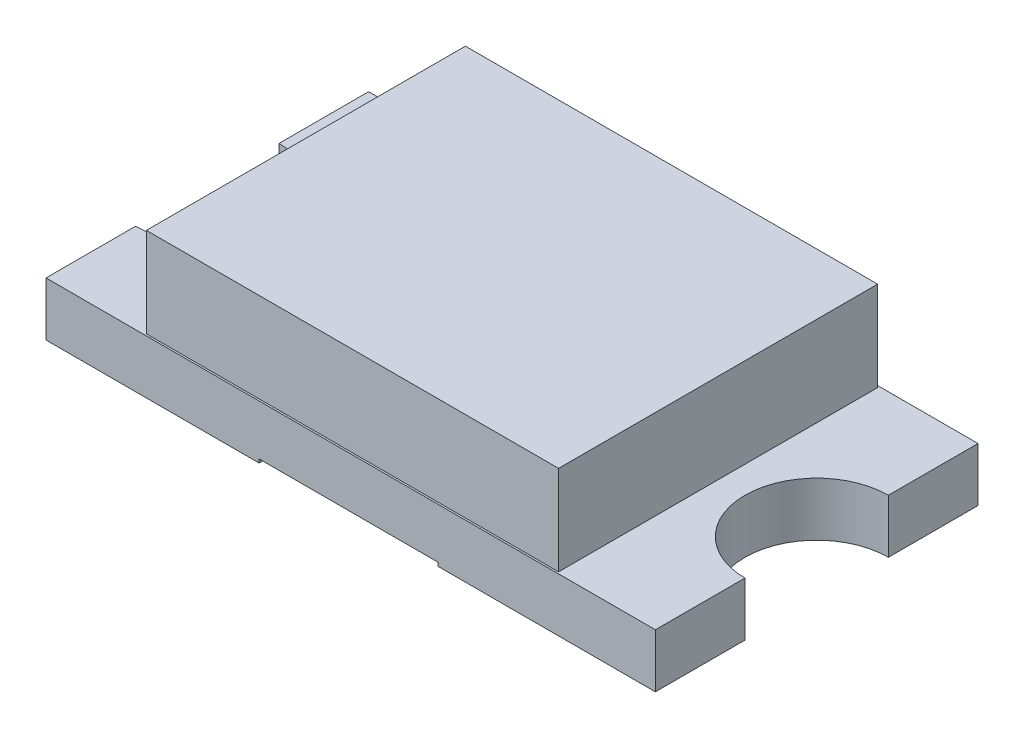
ISO-10303-21;
HEADER;
FILE_DESCRIPTION(('STEP AP214'),'2;1');
FILE_NAME('part.step','',(''),(''),'','','');
FILE_SCHEMA(('AUTOMOTIVE_DESIGN { 1 0 10303 214 1 1 1 1 }'));
ENDSEC;
DATA;
#1=APPLICATION_CONTEXT('core data for automotive mechanical design processes');
#2=APPLICATION_PROTOCOL_DEFINITION('international standard','automotive_design',2000,#1);
#3=PRODUCT_CONTEXT('',#1,'mechanical');
#4=PRODUCT('Part','Part','',(#3));
#5=PRODUCT_RELATED_PRODUCT_CATEGORY('part','',(#4));
#6=PRODUCT_DEFINITION_FORMATION('','',#4);
#7=PRODUCT_DEFINITION_CONTEXT('part definition',#1,'design');
#8=PRODUCT_DEFINITION('design','',#6,#7);
#9=PRODUCT_DEFINITION_SHAPE('','',#8);
#10=(LENGTH_UNIT() NAMED_UNIT(*) SI_UNIT(.MILLI.,.METRE.));
#11=(NAMED_UNIT(*) PLANE_ANGLE_UNIT() SI_UNIT($,.RADIAN.));
#12=(NAMED_UNIT(*) SI_UNIT($,.STERADIAN.) SOLID_ANGLE_UNIT());
#13=UNCERTAINTY_MEASURE_WITH_UNIT(LENGTH_MEASURE(1.E-05),#10,'distance_accuracy_value','');
#14=(GEOMETRIC_REPRESENTATION_CONTEXT(3) GLOBAL_UNCERTAINTY_ASSIGNED_CONTEXT((#13)) GLOBAL_UNIT_ASSIGNED_CONTEXT((#10,
#11,#12)) REPRESENTATION_CONTEXT('',''));
#15=CARTESIAN_POINT('',(0.,0.,0.));
#16=DIRECTION('',(0.,0.,1.));
#17=DIRECTION('',(1.,0.,0.));
#18=AXIS2_PLACEMENT_3D('',#15,#16,#17);
#19=CARTESIAN_POINT('',(0.,0.,0.));
#20=DIRECTION('',(0.,-1.,0.));
#21=DIRECTION('',(0.,0.,-1.));
#22=AXIS2_PLACEMENT_3D('',#19,#20,#21);
#23=PLANE('',#22);
#24=DIRECTION('',(0.,0.,-1.));
#25=VECTOR('',#24,1.);
#26=CARTESIAN_POINT('',(-0.255635297492063,0.,0.45));
#27=LINE('',#26,#25);
#28=CARTESIAN_POINT('',(-0.255635297492063,0.,0.45));
#29=VERTEX_POINT('',#28);
#30=CARTESIAN_POINT('',(-0.255635297492063,0.,-0.45));
#31=VERTEX_POINT('',#30);
#32=EDGE_CURVE('E150',#29,#31,#27,.T.);
#33=ORIENTED_EDGE('',*,*,#32,.F.);
#34=DIRECTION('',(1.,0.,0.));
#35=VECTOR('',#34,1.);
#36=CARTESIAN_POINT('',(-0.85,0.,0.45));
#37=LINE('',#36,#35);
#38=CARTESIAN_POINT('',(-0.85,0.,0.45));
#39=VERTEX_POINT('',#38);
#40=EDGE_CURVE('E247',#39,#29,#37,.T.);
#41=ORIENTED_EDGE('',*,*,#40,.F.);
#42=DIRECTION('',(0.,0.,1.));
#43=VECTOR('',#42,1.);
#44=CARTESIAN_POINT('',(-0.85,0.,0.45));
#45=LINE('',#44,#43);
#46=CARTESIAN_POINT('',(-0.85,0.,0.2));
#47=VERTEX_POINT('',#46);
#48=EDGE_CURVE('E229',#47,#39,#45,.T.);
#49=ORIENTED_EDGE('',*,*,#48,.F.);
#50=CARTESIAN_POINT('',(-0.85,0.,0.));
#51=DIRECTION('',(0.,1.,0.));
#52=DIRECTION('',(0.,0.,1.));
#53=AXIS2_PLACEMENT_3D('',#50,#51,#52);
#54=CIRCLE('',#53,0.2);
#55=CARTESIAN_POINT('',(-0.85,0.,-0.2));
#56=VERTEX_POINT('',#55);
#57=EDGE_CURVE('E219',#47,#56,#54,.T.);
#58=ORIENTED_EDGE('',*,*,#57,.T.);
#59=CARTESIAN_POINT('',(-0.85,0.,-0.45));
#60=VERTEX_POINT('',#59);
#61=EDGE_CURVE('E243',#60,#56,#45,.T.);
#62=ORIENTED_EDGE('',*,*,#61,.F.);
#63=DIRECTION('',(-1.,0.,0.));
#64=VECTOR('',#63,1.);
#65=CARTESIAN_POINT('',(-0.85,0.,-0.45));
#66=LINE('',#65,#64);
#67=EDGE_CURVE('E254',#31,#60,#66,.T.);
#68=ORIENTED_EDGE('',*,*,#67,.F.);
#69=EDGE_LOOP('',(#33,#41,#49,#58,#62,#68));
#70=FACE_BOUND('',#69,.T.);
#71=ADVANCED_FACE('F33',(#70),#23,.T.);
#72=CARTESIAN_POINT('',(0.,0.15,0.));
#73=DIRECTION('',(0.,-1.,0.));
#74=DIRECTION('',(0.,0.,-1.));
#75=AXIS2_PLACEMENT_3D('',#72,#73,#74);
#76=PLANE('',#75);
#77=DIRECTION('',(0.,0.,-1.));
#78=VECTOR('',#77,1.);
#79=CARTESIAN_POINT('',(0.85,0.15,0.45));
#80=LINE('',#79,#78);
#81=CARTESIAN_POINT('',(0.85,0.15,0.45));
#82=VERTEX_POINT('',#81);
#83=CARTESIAN_POINT('',(0.85,0.15,0.2));
#84=VERTEX_POINT('',#83);
#85=EDGE_CURVE('E237',#82,#84,#80,.T.);
#86=ORIENTED_EDGE('',*,*,#85,.T.);
#87=CARTESIAN_POINT('',(0.85,0.15,0.));
#88=DIRECTION('',(0.,1.,0.));
#89=DIRECTION('',(0.,0.,1.));
#90=AXIS2_PLACEMENT_3D('',#87,#88,#89);
#91=CIRCLE('',#90,0.2);
#92=CARTESIAN_POINT('',(0.85,0.15,-0.200000000000001));
#93=VERTEX_POINT('',#92);
#94=EDGE_CURVE('E210',#93,#84,#91,.T.);
#95=ORIENTED_EDGE('',*,*,#94,.F.);
#96=CARTESIAN_POINT('',(0.85,0.15,-0.45));
#97=VERTEX_POINT('',#96);
#98=EDGE_CURVE('E236',#93,#97,#80,.T.);
#99=ORIENTED_EDGE('',*,*,#98,.T.);
#100=DIRECTION('',(-1.,0.,0.));
#101=VECTOR('',#100,1.);
#102=CARTESIAN_POINT('',(-0.85,0.15,-0.45));
#103=LINE('',#102,#101);
#104=CARTESIAN_POINT('',(-0.85,0.15,-0.45));
#105=VERTEX_POINT('',#104);
#106=EDGE_CURVE('E240',#97,#105,#103,.T.);
#107=ORIENTED_EDGE('',*,*,#106,.T.);
#108=DIRECTION('',(0.,0.,1.));
#109=VECTOR('',#108,1.);
#110=CARTESIAN_POINT('',(-0.85,0.15,0.45));
#111=LINE('',#110,#109);
#112=CARTESIAN_POINT('',(-0.85,0.15,-0.2));
#113=VERTEX_POINT('',#112);
#114=EDGE_CURVE('E230',#105,#113,#111,.T.);
#115=ORIENTED_EDGE('',*,*,#114,.T.);
#116=CARTESIAN_POINT('',(-0.85,0.15,0.));
#117=DIRECTION('',(0.,1.,0.));
#118=DIRECTION('',(0.,0.,1.));
#119=AXIS2_PLACEMENT_3D('',#116,#117,#118);
#120=CIRCLE('',#119,0.2);
#121=CARTESIAN_POINT('',(-0.85,0.15,0.2));
#122=VERTEX_POINT('',#121);
#123=EDGE_CURVE('E218',#122,#113,#120,.T.);
#124=ORIENTED_EDGE('',*,*,#123,.F.);
#125=CARTESIAN_POINT('',(-0.85,0.15,0.45));
#126=VERTEX_POINT('',#125);
#127=EDGE_CURVE('E234',#122,#126,#111,.T.);
#128=ORIENTED_EDGE('',*,*,#127,.T.);
#129=DIRECTION('',(1.,0.,0.));
#130=VECTOR('',#129,1.);
#131=CARTESIAN_POINT('',(-0.85,0.15,0.45));
#132=LINE('',#131,#130);
#133=EDGE_CURVE('E233',#126,#82,#132,.T.);
#134=ORIENTED_EDGE('',*,*,#133,.T.);
#135=EDGE_LOOP('',(#86,#95,#99,#107,#115,#124,#128,#134));
#136=FACE_BOUND('',#135,.T.);
#137=DIRECTION('',(0.,0.,1.));
#138=VECTOR('',#137,1.);
#139=CARTESIAN_POINT('',(-0.575,0.15,0.445));
#140=LINE('',#139,#138);
#141=CARTESIAN_POINT('',(-0.575,0.15,-0.445));
#142=VERTEX_POINT('',#141);
#143=CARTESIAN_POINT('',(-0.575,0.15,0.445));
#144=VERTEX_POINT('',#143);
#145=EDGE_CURVE('E176',#142,#144,#140,.T.);
#146=ORIENTED_EDGE('',*,*,#145,.F.);
#147=DIRECTION('',(-1.,0.,0.));
#148=VECTOR('',#147,1.);
#149=CARTESIAN_POINT('',(-0.575,0.15,-0.445));
#150=LINE('',#149,#148);
#151=CARTESIAN_POINT('',(0.575,0.15,-0.445));
#152=VERTEX_POINT('',#151);
#153=EDGE_CURVE('E185',#152,#142,#150,.T.);
#154=ORIENTED_EDGE('',*,*,#153,.F.);
#155=DIRECTION('',(0.,0.,-1.));
#156=VECTOR('',#155,1.);
#157=CARTESIAN_POINT('',(0.575,0.15,0.445));
#158=LINE('',#157,#156);
#159=CARTESIAN_POINT('',(0.575,0.15,0.445));
#160=VERTEX_POINT('',#159);
#161=EDGE_CURVE('E195',#160,#152,#158,.T.);
#162=ORIENTED_EDGE('',*,*,#161,.F.);
#163=DIRECTION('',(1.,0.,0.));
#164=VECTOR('',#163,1.);
#165=CARTESIAN_POINT('',(-0.575,0.15,0.445));
#166=LINE('',#165,#164);
#167=EDGE_CURVE('E56',#144,#160,#166,.T.);
#168=ORIENTED_EDGE('',*,*,#167,.F.);
#169=EDGE_LOOP('',(#146,#154,#162,#168));
#170=FACE_BOUND('',#169,.T.);
#171=ADVANCED_FACE('F283',(#136,#170),#76,.F.);
#172=CARTESIAN_POINT('',(0.85,0.15,0.45));
#173=DIRECTION('',(-1.,0.,0.));
#174=DIRECTION('',(0.,0.,1.));
#175=AXIS2_PLACEMENT_3D('',#172,#173,#174);
#176=PLANE('',#175);
#177=DIRECTION('',(0.,0.,-1.));
#178=VECTOR('',#177,1.);
#179=CARTESIAN_POINT('',(0.85,0.,0.45));
#180=LINE('',#179,#178);
#181=CARTESIAN_POINT('',(0.85,0.,0.45));
#182=VERTEX_POINT('',#181);
#183=CARTESIAN_POINT('',(0.85,0.,0.2));
#184=VERTEX_POINT('',#183);
#185=EDGE_CURVE('E251',#182,#184,#180,.T.);
#186=ORIENTED_EDGE('',*,*,#185,.T.);
#187=DIRECTION('',(0.,1.,0.));
#188=VECTOR('',#187,1.);
#189=CARTESIAN_POINT('',(0.85,0.,0.2));
#190=LINE('',#189,#188);
#191=EDGE_CURVE('E215',#184,#84,#190,.T.);
#192=ORIENTED_EDGE('',*,*,#191,.T.);
#193=ORIENTED_EDGE('',*,*,#85,.F.);
#194=DIRECTION('',(0.,-1.,0.));
#195=VECTOR('',#194,1.);
#196=CARTESIAN_POINT('',(0.85,0.15,0.45));
#197=LINE('',#196,#195);
#198=EDGE_CURVE('E262',#82,#182,#197,.T.);
#199=ORIENTED_EDGE('',*,*,#198,.T.);
#200=EDGE_LOOP('',(#186,#192,#193,#199));
#201=FACE_BOUND('',#200,.T.);
#202=ADVANCED_FACE('F298',(#201),#176,.F.);
#203=CARTESIAN_POINT('',(-0.85,0.15,0.45));
#204=DIRECTION('',(1.,0.,0.));
#205=DIRECTION('',(0.,0.,-1.));
#206=AXIS2_PLACEMENT_3D('',#203,#204,#205);
#207=PLANE('',#206);
#208=ORIENTED_EDGE('',*,*,#61,.T.);
#209=DIRECTION('',(0.,1.,0.));
#210=VECTOR('',#209,1.);
#211=CARTESIAN_POINT('',(-0.85,0.,-0.2));
#212=LINE('',#211,#210);
#213=EDGE_CURVE('E226',#56,#113,#212,.T.);
#214=ORIENTED_EDGE('',*,*,#213,.T.);
#215=ORIENTED_EDGE('',*,*,#114,.F.);
#216=DIRECTION('',(0.,-1.,0.));
#217=VECTOR('',#216,1.);
#218=CARTESIAN_POINT('',(-0.85,0.15,-0.45));
#219=LINE('',#218,#217);
#220=EDGE_CURVE('E242',#105,#60,#219,.T.);
#221=ORIENTED_EDGE('',*,*,#220,.T.);
#222=EDGE_LOOP('',(#208,#214,#215,#221));
#223=FACE_BOUND('',#222,.T.);
#224=ADVANCED_FACE('F280',(#223),#207,.F.);
#225=ORIENTED_EDGE('',*,*,#127,.F.);
#226=DIRECTION('',(0.,1.,0.));
#227=VECTOR('',#226,1.);
#228=CARTESIAN_POINT('',(-0.85,0.,0.2));
#229=LINE('',#228,#227);
#230=EDGE_CURVE('E222',#122,#47,#229,.F.);
#231=ORIENTED_EDGE('',*,*,#230,.T.);
#232=ORIENTED_EDGE('',*,*,#48,.T.);
#233=DIRECTION('',(0.,-1.,0.));
#234=VECTOR('',#233,1.);
#235=CARTESIAN_POINT('',(-0.85,0.15,0.45));
#236=LINE('',#235,#234);
#237=EDGE_CURVE('E41',#126,#39,#236,.T.);
#238=ORIENTED_EDGE('',*,*,#237,.F.);
#239=EDGE_LOOP('',(#225,#231,#232,#238));
#240=FACE_BOUND('',#239,.T.);
#241=ADVANCED_FACE('F35',(#240),#207,.F.);
#242=CARTESIAN_POINT('',(-0.85,0.15,0.45));
#243=DIRECTION('',(0.,0.,-1.));
#244=DIRECTION('',(-1.,0.,0.));
#245=AXIS2_PLACEMENT_3D('',#242,#243,#244);
#246=PLANE('',#245);
#247=ORIENTED_EDGE('',*,*,#40,.T.);
#248=DIRECTION('',(0.,-1.,0.));
#249=VECTOR('',#248,1.);
#250=CARTESIAN_POINT('',(-0.255635297492063,0.01,0.45));
#251=LINE('',#250,#249);
#252=CARTESIAN_POINT('',(-0.255635297492063,0.01,0.45));
#253=VERTEX_POINT('',#252);
#254=EDGE_CURVE('E174',#253,#29,#251,.T.);
#255=ORIENTED_EDGE('',*,*,#254,.F.);
#256=DIRECTION('',(-1.,0.,0.));
#257=VECTOR('',#256,1.);
#258=CARTESIAN_POINT('',(-0.255635297492063,0.01,0.45));
#259=LINE('',#258,#257);
#260=CARTESIAN_POINT('',(0.243699558097887,0.01,0.45));
#261=VERTEX_POINT('',#260);
#262=EDGE_CURVE('E154',#261,#253,#259,.T.);
#263=ORIENTED_EDGE('',*,*,#262,.F.);
#264=DIRECTION('',(0.,-1.,0.));
#265=VECTOR('',#264,1.);
#266=CARTESIAN_POINT('',(0.243699558097887,0.01,0.45));
#267=LINE('',#266,#265);
#268=CARTESIAN_POINT('',(0.243699558097887,0.,0.45));
#269=VERTEX_POINT('',#268);
#270=EDGE_CURVE('E177',#261,#269,#267,.T.);
#271=ORIENTED_EDGE('',*,*,#270,.T.);
#272=EDGE_CURVE('E246',#269,#182,#37,.T.);
#273=ORIENTED_EDGE('',*,*,#272,.T.);
#274=ORIENTED_EDGE('',*,*,#198,.F.);
#275=ORIENTED_EDGE('',*,*,#133,.F.);
#276=ORIENTED_EDGE('',*,*,#237,.T.);
#277=EDGE_LOOP('',(#247,#255,#263,#271,#273,#274,#275,#276));
#278=FACE_BOUND('',#277,.T.);
#279=ADVANCED_FACE('F268',(#278),#246,.F.);
#280=ORIENTED_EDGE('',*,*,#98,.F.);
#281=DIRECTION('',(0.,1.,0.));
#282=VECTOR('',#281,1.);
#283=CARTESIAN_POINT('',(0.85,0.,-0.200000000000001));
#284=LINE('',#283,#282);
#285=CARTESIAN_POINT('',(0.85,0.,-0.200000000000001));
#286=VERTEX_POINT('',#285);
#287=EDGE_CURVE('E212',#93,#286,#284,.F.);
#288=ORIENTED_EDGE('',*,*,#287,.T.);
#289=CARTESIAN_POINT('',(0.85,0.,-0.45));
#290=VERTEX_POINT('',#289);
#291=EDGE_CURVE('E250',#286,#290,#180,.T.);
#292=ORIENTED_EDGE('',*,*,#291,.T.);
#293=DIRECTION('',(0.,-1.,0.));
#294=VECTOR('',#293,1.);
#295=CARTESIAN_POINT('',(0.85,0.15,-0.45));
#296=LINE('',#295,#294);
#297=EDGE_CURVE('E259',#97,#290,#296,.T.);
#298=ORIENTED_EDGE('',*,*,#297,.F.);
#299=EDGE_LOOP('',(#280,#288,#292,#298));
#300=FACE_BOUND('',#299,.T.);
#301=ADVANCED_FACE('F301',(#300),#176,.F.);
#302=CARTESIAN_POINT('',(-0.85,0.15,-0.45));
#303=DIRECTION('',(0.,0.,1.));
#304=DIRECTION('',(1.,0.,0.));
#305=AXIS2_PLACEMENT_3D('',#302,#303,#304);
#306=PLANE('',#305);
#307=DIRECTION('',(1.,0.,0.));
#308=VECTOR('',#307,1.);
#309=CARTESIAN_POINT('',(-0.255635297492063,0.01,-0.45));
#310=LINE('',#309,#308);
#311=CARTESIAN_POINT('',(-0.255635297492063,0.01,-0.45));
#312=VERTEX_POINT('',#311);
#313=CARTESIAN_POINT('',(0.243699558097887,0.01,-0.45));
#314=VERTEX_POINT('',#313);
#315=EDGE_CURVE('E160',#312,#314,#310,.T.);
#316=ORIENTED_EDGE('',*,*,#315,.F.);
#317=DIRECTION('',(0.,-1.,0.));
#318=VECTOR('',#317,1.);
#319=CARTESIAN_POINT('',(-0.255635297492063,0.01,-0.45));
#320=LINE('',#319,#318);
#321=EDGE_CURVE('E144',#312,#31,#320,.T.);
#322=ORIENTED_EDGE('',*,*,#321,.T.);
#323=ORIENTED_EDGE('',*,*,#67,.T.);
#324=ORIENTED_EDGE('',*,*,#220,.F.);
#325=ORIENTED_EDGE('',*,*,#106,.F.);
#326=ORIENTED_EDGE('',*,*,#297,.T.);
#327=CARTESIAN_POINT('',(0.243699558097887,0.,-0.45));
#328=VERTEX_POINT('',#327);
#329=EDGE_CURVE('E255',#290,#328,#66,.T.);
#330=ORIENTED_EDGE('',*,*,#329,.T.);
#331=DIRECTION('',(0.,-1.,0.));
#332=VECTOR('',#331,1.);
#333=CARTESIAN_POINT('',(0.243699558097887,0.01,-0.45));
#334=LINE('',#333,#332);
#335=EDGE_CURVE('E48',#314,#328,#334,.T.);
#336=ORIENTED_EDGE('',*,*,#335,.F.);
#337=EDGE_LOOP('',(#316,#322,#323,#324,#325,#326,#330,#336));
#338=FACE_BOUND('',#337,.T.);
#339=ADVANCED_FACE('F165',(#338),#306,.F.);
#340=DIRECTION('',(0.,0.,1.));
#341=VECTOR('',#340,1.);
#342=CARTESIAN_POINT('',(0.243699558097887,0.,0.45));
#343=LINE('',#342,#341);
#344=EDGE_CURVE('E163',#328,#269,#343,.T.);
#345=ORIENTED_EDGE('',*,*,#344,.F.);
#346=ORIENTED_EDGE('',*,*,#329,.F.);
#347=ORIENTED_EDGE('',*,*,#291,.F.);
#348=CARTESIAN_POINT('',(0.85,0.,0.));
#349=DIRECTION('',(0.,-1.,0.));
#350=DIRECTION('',(0.,0.,-1.));
#351=AXIS2_PLACEMENT_3D('',#348,#349,#350);
#352=CIRCLE('',#351,0.2);
#353=EDGE_CURVE('E11',#184,#286,#352,.T.);
#354=ORIENTED_EDGE('',*,*,#353,.F.);
#355=ORIENTED_EDGE('',*,*,#185,.F.);
#356=ORIENTED_EDGE('',*,*,#272,.F.);
#357=EDGE_LOOP('',(#345,#346,#347,#354,#355,#356));
#358=FACE_BOUND('',#357,.T.);
#359=ADVANCED_FACE('F291',(#358),#23,.T.);
#360=CARTESIAN_POINT('',(-0.85,0.,0.));
#361=DIRECTION('',(0.,1.,0.));
#362=DIRECTION('',(0.,0.,1.));
#363=AXIS2_PLACEMENT_3D('',#360,#361,#362);
#364=CYLINDRICAL_SURFACE('',#363,0.2);
#365=ORIENTED_EDGE('',*,*,#57,.F.);
#366=ORIENTED_EDGE('',*,*,#230,.F.);
#367=ORIENTED_EDGE('',*,*,#123,.T.);
#368=ORIENTED_EDGE('',*,*,#213,.F.);
#369=EDGE_LOOP('',(#365,#366,#367,#368));
#370=FACE_BOUND('',#369,.T.);
#371=ADVANCED_FACE('F320',(#370),#364,.F.);
#372=CARTESIAN_POINT('',(0.85,0.,0.));
#373=DIRECTION('',(0.,1.,0.));
#374=DIRECTION('',(0.,0.,1.));
#375=AXIS2_PLACEMENT_3D('',#372,#373,#374);
#376=CYLINDRICAL_SURFACE('',#375,0.2);
#377=ORIENTED_EDGE('',*,*,#353,.T.);
#378=ORIENTED_EDGE('',*,*,#287,.F.);
#379=ORIENTED_EDGE('',*,*,#94,.T.);
#380=ORIENTED_EDGE('',*,*,#191,.F.);
#381=EDGE_LOOP('',(#377,#378,#379,#380));
#382=FACE_BOUND('',#381,.T.);
#383=ADVANCED_FACE('F300',(#382),#376,.F.);
#384=CARTESIAN_POINT('',(-0.575,0.4,0.445));
#385=DIRECTION('',(1.,0.,0.));
#386=DIRECTION('',(0.,0.,-1.));
#387=AXIS2_PLACEMENT_3D('',#384,#385,#386);
#388=PLANE('',#387);
#389=ORIENTED_EDGE('',*,*,#145,.T.);
#390=DIRECTION('',(0.,-1.,0.));
#391=VECTOR('',#390,1.);
#392=CARTESIAN_POINT('',(-0.575,0.4,0.445));
#393=LINE('',#392,#391);
#394=CARTESIAN_POINT('',(-0.575,0.4,0.445));
#395=VERTEX_POINT('',#394);
#396=EDGE_CURVE('E208',#395,#144,#393,.T.);
#397=ORIENTED_EDGE('',*,*,#396,.F.);
#398=DIRECTION('',(0.,0.,1.));
#399=VECTOR('',#398,1.);
#400=CARTESIAN_POINT('',(-0.575,0.4,0.445));
#401=LINE('',#400,#399);
#402=CARTESIAN_POINT('',(-0.575,0.4,-0.445));
#403=VERTEX_POINT('',#402);
#404=EDGE_CURVE('E181',#403,#395,#401,.T.);
#405=ORIENTED_EDGE('',*,*,#404,.F.);
#406=DIRECTION('',(0.,-1.,0.));
#407=VECTOR('',#406,1.);
#408=CARTESIAN_POINT('',(-0.575,0.4,-0.445));
#409=LINE('',#408,#407);
#410=EDGE_CURVE('E191',#403,#142,#409,.T.);
#411=ORIENTED_EDGE('',*,*,#410,.T.);
#412=EDGE_LOOP('',(#389,#397,#405,#411));
#413=FACE_BOUND('',#412,.T.);
#414=ADVANCED_FACE('F330',(#413),#388,.F.);
#415=CARTESIAN_POINT('',(-0.575,0.4,0.445));
#416=DIRECTION('',(0.,0.,-1.));
#417=DIRECTION('',(-1.,0.,0.));
#418=AXIS2_PLACEMENT_3D('',#415,#416,#417);
#419=PLANE('',#418);
#420=ORIENTED_EDGE('',*,*,#167,.T.);
#421=DIRECTION('',(0.,-1.,0.));
#422=VECTOR('',#421,1.);
#423=CARTESIAN_POINT('',(0.575,0.4,0.445));
#424=LINE('',#423,#422);
#425=CARTESIAN_POINT('',(0.575,0.4,0.445));
#426=VERTEX_POINT('',#425);
#427=EDGE_CURVE('E205',#426,#160,#424,.T.);
#428=ORIENTED_EDGE('',*,*,#427,.F.);
#429=DIRECTION('',(1.,0.,0.));
#430=VECTOR('',#429,1.);
#431=CARTESIAN_POINT('',(-0.575,0.4,0.445));
#432=LINE('',#431,#430);
#433=EDGE_CURVE('E184',#395,#426,#432,.T.);
#434=ORIENTED_EDGE('',*,*,#433,.F.);
#435=ORIENTED_EDGE('',*,*,#396,.T.);
#436=EDGE_LOOP('',(#420,#428,#434,#435));
#437=FACE_BOUND('',#436,.T.);
#438=ADVANCED_FACE('F335',(#437),#419,.F.);
#439=CARTESIAN_POINT('',(0.575,0.4,0.445));
#440=DIRECTION('',(-1.,0.,0.));
#441=DIRECTION('',(0.,0.,1.));
#442=AXIS2_PLACEMENT_3D('',#439,#440,#441);
#443=PLANE('',#442);
#444=ORIENTED_EDGE('',*,*,#161,.T.);
#445=DIRECTION('',(0.,-1.,0.));
#446=VECTOR('',#445,1.);
#447=CARTESIAN_POINT('',(0.575,0.4,-0.445));
#448=LINE('',#447,#446);
#449=CARTESIAN_POINT('',(0.575,0.4,-0.445));
#450=VERTEX_POINT('',#449);
#451=EDGE_CURVE('E202',#450,#152,#448,.T.);
#452=ORIENTED_EDGE('',*,*,#451,.F.);
#453=DIRECTION('',(0.,0.,-1.));
#454=VECTOR('',#453,1.);
#455=CARTESIAN_POINT('',(0.575,0.4,0.445));
#456=LINE('',#455,#454);
#457=EDGE_CURVE('E187',#426,#450,#456,.T.);
#458=ORIENTED_EDGE('',*,*,#457,.F.);
#459=ORIENTED_EDGE('',*,*,#427,.T.);
#460=EDGE_LOOP('',(#444,#452,#458,#459));
#461=FACE_BOUND('',#460,.T.);
#462=ADVANCED_FACE('F339',(#461),#443,.F.);
#463=CARTESIAN_POINT('',(-0.575,0.4,-0.445));
#464=DIRECTION('',(0.,0.,1.));
#465=DIRECTION('',(1.,0.,0.));
#466=AXIS2_PLACEMENT_3D('',#463,#464,#465);
#467=PLANE('',#466);
#468=ORIENTED_EDGE('',*,*,#153,.T.);
#469=ORIENTED_EDGE('',*,*,#410,.F.);
#470=DIRECTION('',(-1.,0.,0.));
#471=VECTOR('',#470,1.);
#472=CARTESIAN_POINT('',(-0.575,0.4,-0.445));
#473=LINE('',#472,#471);
#474=EDGE_CURVE('E189',#450,#403,#473,.T.);
#475=ORIENTED_EDGE('',*,*,#474,.F.);
#476=ORIENTED_EDGE('',*,*,#451,.T.);
#477=EDGE_LOOP('',(#468,#469,#475,#476));
#478=FACE_BOUND('',#477,.T.);
#479=ADVANCED_FACE('F343',(#478),#467,.F.);
#480=CARTESIAN_POINT('',(0.,0.4,0.));
#481=DIRECTION('',(0.,-1.,0.));
#482=DIRECTION('',(0.,0.,-1.));
#483=AXIS2_PLACEMENT_3D('',#480,#481,#482);
#484=PLANE('',#483);
#485=ORIENTED_EDGE('',*,*,#404,.T.);
#486=ORIENTED_EDGE('',*,*,#433,.T.);
#487=ORIENTED_EDGE('',*,*,#457,.T.);
#488=ORIENTED_EDGE('',*,*,#474,.T.);
#489=EDGE_LOOP('',(#485,#486,#487,#488));
#490=FACE_BOUND('',#489,.T.);
#491=ADVANCED_FACE('F347',(#490),#484,.F.);
#492=CARTESIAN_POINT('',(-0.255635297492063,0.01,0.45));
#493=DIRECTION('',(-1.,0.,0.));
#494=DIRECTION('',(0.,0.,1.));
#495=AXIS2_PLACEMENT_3D('',#492,#493,#494);
#496=PLANE('',#495);
#497=ORIENTED_EDGE('',*,*,#32,.T.);
#498=ORIENTED_EDGE('',*,*,#321,.F.);
#499=DIRECTION('',(0.,0.,-1.));
#500=VECTOR('',#499,1.);
#501=CARTESIAN_POINT('',(-0.255635297492063,0.01,0.45));
#502=LINE('',#501,#500);
#503=EDGE_CURVE('E147',#253,#312,#502,.T.);
#504=ORIENTED_EDGE('',*,*,#503,.F.);
#505=ORIENTED_EDGE('',*,*,#254,.T.);
#506=EDGE_LOOP('',(#497,#498,#504,#505));
#507=FACE_BOUND('',#506,.T.);
#508=ADVANCED_FACE('F146',(#507),#496,.F.);
#509=CARTESIAN_POINT('',(0.243699558097887,0.01,0.45));
#510=DIRECTION('',(1.,0.,0.));
#511=DIRECTION('',(0.,0.,-1.));
#512=AXIS2_PLACEMENT_3D('',#509,#510,#511);
#513=PLANE('',#512);
#514=ORIENTED_EDGE('',*,*,#344,.T.);
#515=ORIENTED_EDGE('',*,*,#270,.F.);
#516=DIRECTION('',(0.,0.,1.));
#517=VECTOR('',#516,1.);
#518=CARTESIAN_POINT('',(0.243699558097887,0.01,0.45));
#519=LINE('',#518,#517);
#520=EDGE_CURVE('E167',#314,#261,#519,.T.);
#521=ORIENTED_EDGE('',*,*,#520,.F.);
#522=ORIENTED_EDGE('',*,*,#335,.T.);
#523=EDGE_LOOP('',(#514,#515,#521,#522));
#524=FACE_BOUND('',#523,.T.);
#525=ADVANCED_FACE('F295',(#524),#513,.F.);
#526=CARTESIAN_POINT('',(0.,0.01,0.));
#527=DIRECTION('',(0.,-1.,0.));
#528=DIRECTION('',(0.,0.,-1.));
#529=AXIS2_PLACEMENT_3D('',#526,#527,#528);
#530=PLANE('',#529);
#531=ORIENTED_EDGE('',*,*,#503,.T.);
#532=ORIENTED_EDGE('',*,*,#315,.T.);
#533=ORIENTED_EDGE('',*,*,#520,.T.);
#534=ORIENTED_EDGE('',*,*,#262,.T.);
#535=EDGE_LOOP('',(#531,#532,#533,#534));
#536=FACE_BOUND('',#535,.T.);
#537=ADVANCED_FACE('F158',(#536),#530,.T.);
#538=CLOSED_SHELL('',(#71,#171,#202,#224,#241,#279,#301,#339,#359,#371,#383,#414,#438,#462,#479,
#491,#508,#525,#537));
#539=MANIFOLD_SOLID_BREP('B2',#538);
#540=ADVANCED_BREP_SHAPE_REPRESENTATION('',(#18,#539),#14);
#541=SHAPE_DEFINITION_REPRESENTATION(#9,#540);
ENDSEC;
END-ISO-10303-21;
